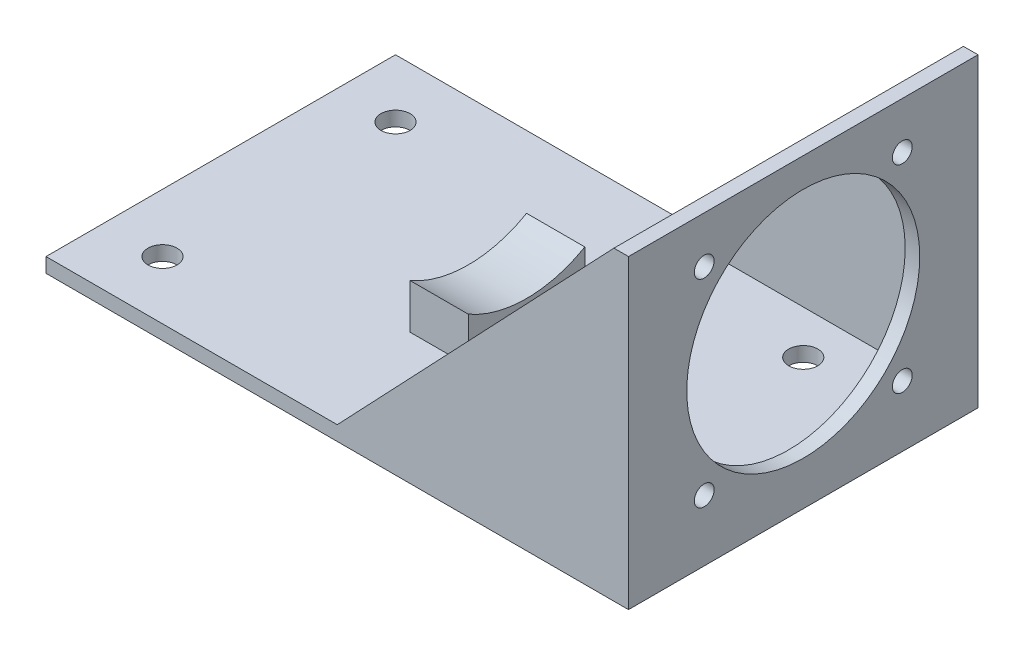
ISO-10303-21;
HEADER;
FILE_DESCRIPTION(('STEP AP214'),'2;1');
FILE_NAME('part.step','',(''),(''),'','','');
FILE_SCHEMA(('AUTOMOTIVE_DESIGN { 1 0 10303 214 1 1 1 1 }'));
ENDSEC;
DATA;
#1=APPLICATION_CONTEXT('core data for automotive mechanical design processes');
#2=APPLICATION_PROTOCOL_DEFINITION('international standard','automotive_design',2000,#1);
#3=PRODUCT_CONTEXT('',#1,'mechanical');
#4=PRODUCT('Part','Part','',(#3));
#5=PRODUCT_RELATED_PRODUCT_CATEGORY('part','',(#4));
#6=PRODUCT_DEFINITION_FORMATION('','',#4);
#7=PRODUCT_DEFINITION_CONTEXT('part definition',#1,'design');
#8=PRODUCT_DEFINITION('design','',#6,#7);
#9=PRODUCT_DEFINITION_SHAPE('','',#8);
#10=(LENGTH_UNIT() NAMED_UNIT(*) SI_UNIT(.MILLI.,.METRE.));
#11=(NAMED_UNIT(*) PLANE_ANGLE_UNIT() SI_UNIT($,.RADIAN.));
#12=(NAMED_UNIT(*) SI_UNIT($,.STERADIAN.) SOLID_ANGLE_UNIT());
#13=UNCERTAINTY_MEASURE_WITH_UNIT(LENGTH_MEASURE(1.E-05),#10,'distance_accuracy_value','');
#14=(GEOMETRIC_REPRESENTATION_CONTEXT(3) GLOBAL_UNCERTAINTY_ASSIGNED_CONTEXT((#13)) GLOBAL_UNIT_ASSIGNED_CONTEXT((#10,
#11,#12)) REPRESENTATION_CONTEXT('',''));
#15=CARTESIAN_POINT('',(0.,0.,0.));
#16=DIRECTION('',(0.,0.,1.));
#17=DIRECTION('',(1.,0.,0.));
#18=AXIS2_PLACEMENT_3D('',#15,#16,#17);
#19=CARTESIAN_POINT('',(0.,6.34999999999999,0.));
#20=DIRECTION('',(0.,1.,0.));
#21=DIRECTION('',(0.,0.,1.));
#22=AXIS2_PLACEMENT_3D('',#19,#20,#21);
#23=PLANE('',#22);
#24=CARTESIAN_POINT('',(76.2,6.34999999999999,-50.8));
#25=DIRECTION('',(0.,1.,0.));
#26=DIRECTION('',(0.,0.,1.));
#27=AXIS2_PLACEMENT_3D('',#24,#25,#26);
#28=CIRCLE('',#27,6.35);
#29=CARTESIAN_POINT('',(76.2,6.34999999999999,-44.45));
#30=VERTEX_POINT('',#29);
#31=EDGE_CURVE('E438',#30,#30,#28,.T.);
#32=ORIENTED_EDGE('',*,*,#31,.F.);
#33=EDGE_LOOP('',(#32));
#34=FACE_BOUND('',#33,.T.);
#35=CARTESIAN_POINT('',(76.2,6.34999999999999,50.8));
#36=DIRECTION('',(0.,1.,0.));
#37=DIRECTION('',(0.,0.,1.));
#38=AXIS2_PLACEMENT_3D('',#35,#36,#37);
#39=CIRCLE('',#38,6.35);
#40=CARTESIAN_POINT('',(76.2,6.34999999999999,57.15));
#41=VERTEX_POINT('',#40);
#42=EDGE_CURVE('E434',#41,#41,#39,.T.);
#43=ORIENTED_EDGE('',*,*,#42,.F.);
#44=EDGE_LOOP('',(#43));
#45=FACE_BOUND('',#44,.T.);
#46=CARTESIAN_POINT('',(-101.6,6.34999999999999,50.8));
#47=DIRECTION('',(0.,1.,0.));
#48=DIRECTION('',(0.,0.,1.));
#49=AXIS2_PLACEMENT_3D('',#46,#47,#48);
#50=CIRCLE('',#49,6.35);
#51=CARTESIAN_POINT('',(-101.6,6.34999999999999,57.15));
#52=VERTEX_POINT('',#51);
#53=EDGE_CURVE('E431',#52,#52,#50,.T.);
#54=ORIENTED_EDGE('',*,*,#53,.F.);
#55=EDGE_LOOP('',(#54));
#56=FACE_BOUND('',#55,.T.);
#57=CARTESIAN_POINT('',(-101.6,6.34999999999999,-50.8));
#58=DIRECTION('',(0.,1.,0.));
#59=DIRECTION('',(0.,0.,1.));
#60=AXIS2_PLACEMENT_3D('',#57,#58,#59);
#61=CIRCLE('',#60,6.35);
#62=CARTESIAN_POINT('',(-101.6,6.34999999999999,-44.45));
#63=VERTEX_POINT('',#62);
#64=EDGE_CURVE('E275',#63,#63,#61,.T.);
#65=ORIENTED_EDGE('',*,*,#64,.F.);
#66=EDGE_LOOP('',(#65));
#67=FACE_BOUND('',#66,.T.);
#68=DIRECTION('',(0.,0.,-1.));
#69=VECTOR('',#68,1.);
#70=CARTESIAN_POINT('',(0.,6.34999999999984,-69.85));
#71=LINE('',#70,#69);
#72=CARTESIAN_POINT('',(0.,6.34999999999984,-69.85));
#73=VERTEX_POINT('',#72);
#74=CARTESIAN_POINT('',(0.,6.34999999999999,-76.2));
#75=VERTEX_POINT('',#74);
#76=EDGE_CURVE('E178',#73,#75,#71,.T.);
#77=ORIENTED_EDGE('',*,*,#76,.T.);
#78=DIRECTION('',(-1.,0.,0.));
#79=VECTOR('',#78,1.);
#80=CARTESIAN_POINT('',(-127.,6.34999999999999,-76.2));
#81=LINE('',#80,#79);
#82=CARTESIAN_POINT('',(-127.,6.34999999999999,-76.2));
#83=VERTEX_POINT('',#82);
#84=EDGE_CURVE('E245',#75,#83,#81,.T.);
#85=ORIENTED_EDGE('',*,*,#84,.T.);
#86=DIRECTION('',(0.,0.,1.));
#87=VECTOR('',#86,1.);
#88=CARTESIAN_POINT('',(-127.,6.34999999999999,-76.2));
#89=LINE('',#88,#87);
#90=CARTESIAN_POINT('',(-127.,6.34999999999998,76.2));
#91=VERTEX_POINT('',#90);
#92=EDGE_CURVE('E247',#83,#91,#89,.T.);
#93=ORIENTED_EDGE('',*,*,#92,.T.);
#94=DIRECTION('',(1.,0.,0.));
#95=VECTOR('',#94,1.);
#96=CARTESIAN_POINT('',(-127.,6.34999999999998,76.2));
#97=LINE('',#96,#95);
#98=CARTESIAN_POINT('',(0.,6.34999999999998,76.2));
#99=VERTEX_POINT('',#98);
#100=EDGE_CURVE('E250',#91,#99,#97,.T.);
#101=ORIENTED_EDGE('',*,*,#100,.T.);
#102=DIRECTION('',(0.,0.,1.));
#103=VECTOR('',#102,1.);
#104=CARTESIAN_POINT('',(0.,6.34999999999999,69.85));
#105=LINE('',#104,#103);
#106=CARTESIAN_POINT('',(0.,6.34999999999999,69.85));
#107=VERTEX_POINT('',#106);
#108=EDGE_CURVE('E194',#107,#99,#105,.T.);
#109=ORIENTED_EDGE('',*,*,#108,.F.);
#110=DIRECTION('',(1.,0.,0.));
#111=VECTOR('',#110,1.);
#112=CARTESIAN_POINT('',(0.,6.34999999999999,69.85));
#113=LINE('',#112,#111);
#114=CARTESIAN_POINT('',(120.65,6.34999999999999,69.85));
#115=VERTEX_POINT('',#114);
#116=EDGE_CURVE('E188',#107,#115,#113,.T.);
#117=ORIENTED_EDGE('',*,*,#116,.T.);
#118=DIRECTION('',(0.,0.,-1.));
#119=VECTOR('',#118,1.);
#120=CARTESIAN_POINT('',(120.65,6.34999999999998,76.2));
#121=LINE('',#120,#119);
#122=CARTESIAN_POINT('',(120.65,6.34999999999984,-69.85));
#123=VERTEX_POINT('',#122);
#124=EDGE_CURVE('E229',#115,#123,#121,.T.);
#125=ORIENTED_EDGE('',*,*,#124,.T.);
#126=DIRECTION('',(-1.,0.,0.));
#127=VECTOR('',#126,1.);
#128=CARTESIAN_POINT('',(0.,6.34999999999984,-69.85));
#129=LINE('',#128,#127);
#130=EDGE_CURVE('E172',#123,#73,#129,.T.);
#131=ORIENTED_EDGE('',*,*,#130,.T.);
#132=EDGE_LOOP('',(#77,#85,#93,#101,#109,#117,#125,#131));
#133=FACE_BOUND('',#132,.T.);
#134=DIRECTION('',(-1.,0.,0.));
#135=VECTOR('',#134,1.);
#136=CARTESIAN_POINT('',(-19.05,6.34999999999998,-25.4));
#137=LINE('',#136,#135);
#138=CARTESIAN_POINT('',(6.34999999999997,6.34999999999998,-25.4));
#139=VERTEX_POINT('',#138);
#140=CARTESIAN_POINT('',(-19.05,6.34999999999998,-25.4));
#141=VERTEX_POINT('',#140);
#142=EDGE_CURVE('E159',#139,#141,#137,.T.);
#143=ORIENTED_EDGE('',*,*,#142,.F.);
#144=DIRECTION('',(0.,0.,-1.));
#145=VECTOR('',#144,1.);
#146=CARTESIAN_POINT('',(6.34999999999997,6.34999999999998,-25.4));
#147=LINE('',#146,#145);
#148=CARTESIAN_POINT('',(6.34999999999997,6.34999999999999,25.4));
#149=VERTEX_POINT('',#148);
#150=EDGE_CURVE('E150',#149,#139,#147,.T.);
#151=ORIENTED_EDGE('',*,*,#150,.F.);
#152=DIRECTION('',(1.,0.,0.));
#153=VECTOR('',#152,1.);
#154=CARTESIAN_POINT('',(-19.05,6.34999999999999,25.4));
#155=LINE('',#154,#153);
#156=CARTESIAN_POINT('',(-19.05,6.34999999999999,25.4));
#157=VERTEX_POINT('',#156);
#158=EDGE_CURVE('E446',#157,#149,#155,.T.);
#159=ORIENTED_EDGE('',*,*,#158,.F.);
#160=DIRECTION('',(0.,0.,1.));
#161=VECTOR('',#160,1.);
#162=CARTESIAN_POINT('',(-19.05,6.34999999999998,-25.4));
#163=LINE('',#162,#161);
#164=EDGE_CURVE('E444',#141,#157,#163,.T.);
#165=ORIENTED_EDGE('',*,*,#164,.F.);
#166=EDGE_LOOP('',(#143,#151,#159,#165));
#167=FACE_BOUND('',#166,.T.);
#168=ADVANCED_FACE('F48',(#34,#45,#56,#67,#133,#167),#23,.T.);
#169=CARTESIAN_POINT('',(120.65,0.,0.));
#170=DIRECTION('',(-1.,0.,0.));
#171=DIRECTION('',(0.,0.,1.));
#172=AXIS2_PLACEMENT_3D('',#169,#170,#171);
#173=PLANE('',#172);
#174=CARTESIAN_POINT('',(120.65,113.03,43.18));
#175=DIRECTION('',(1.,0.,0.));
#176=DIRECTION('',(0.,0.,-1.));
#177=AXIS2_PLACEMENT_3D('',#174,#175,#176);
#178=CIRCLE('',#177,4.318);
#179=CARTESIAN_POINT('',(120.65,113.03,38.862));
#180=VERTEX_POINT('',#179);
#181=EDGE_CURVE('E199',#180,#180,#178,.T.);
#182=ORIENTED_EDGE('',*,*,#181,.T.);
#183=EDGE_LOOP('',(#182));
#184=FACE_BOUND('',#183,.T.);
#185=CARTESIAN_POINT('',(120.65,113.03,-43.18));
#186=DIRECTION('',(1.,0.,0.));
#187=DIRECTION('',(0.,0.,-1.));
#188=AXIS2_PLACEMENT_3D('',#185,#186,#187);
#189=CIRCLE('',#188,4.318);
#190=CARTESIAN_POINT('',(120.65,113.03,-47.498));
#191=VERTEX_POINT('',#190);
#192=EDGE_CURVE('E205',#191,#191,#189,.T.);
#193=ORIENTED_EDGE('',*,*,#192,.T.);
#194=EDGE_LOOP('',(#193));
#195=FACE_BOUND('',#194,.T.);
#196=CARTESIAN_POINT('',(120.65,26.67,-43.18));
#197=DIRECTION('',(1.,0.,0.));
#198=DIRECTION('',(0.,0.,-1.));
#199=AXIS2_PLACEMENT_3D('',#196,#197,#198);
#200=CIRCLE('',#199,4.318);
#201=CARTESIAN_POINT('',(120.65,26.67,-47.498));
#202=VERTEX_POINT('',#201);
#203=EDGE_CURVE('E211',#202,#202,#200,.T.);
#204=ORIENTED_EDGE('',*,*,#203,.T.);
#205=EDGE_LOOP('',(#204));
#206=FACE_BOUND('',#205,.T.);
#207=CARTESIAN_POINT('',(120.65,26.67,43.18));
#208=DIRECTION('',(1.,0.,0.));
#209=DIRECTION('',(0.,0.,-1.));
#210=AXIS2_PLACEMENT_3D('',#207,#208,#209);
#211=CIRCLE('',#210,4.318);
#212=CARTESIAN_POINT('',(120.65,26.67,38.862));
#213=VERTEX_POINT('',#212);
#214=EDGE_CURVE('E217',#213,#213,#211,.T.);
#215=ORIENTED_EDGE('',*,*,#214,.T.);
#216=EDGE_LOOP('',(#215));
#217=FACE_BOUND('',#216,.T.);
#218=CARTESIAN_POINT('',(120.65,69.85,0.));
#219=DIRECTION('',(1.,0.,0.));
#220=DIRECTION('',(0.,0.,-1.));
#221=AXIS2_PLACEMENT_3D('',#218,#219,#220);
#222=CIRCLE('',#221,50.8);
#223=CARTESIAN_POINT('',(120.65,69.85,-50.8));
#224=VERTEX_POINT('',#223);
#225=EDGE_CURVE('E223',#224,#224,#222,.T.);
#226=ORIENTED_EDGE('',*,*,#225,.T.);
#227=EDGE_LOOP('',(#226));
#228=FACE_BOUND('',#227,.T.);
#229=DIRECTION('',(0.,0.,1.));
#230=VECTOR('',#229,1.);
#231=CARTESIAN_POINT('',(120.65,133.35,76.2));
#232=LINE('',#231,#230);
#233=CARTESIAN_POINT('',(120.65,133.35,-69.85));
#234=VERTEX_POINT('',#233);
#235=CARTESIAN_POINT('',(120.65,133.35,69.85));
#236=VERTEX_POINT('',#235);
#237=EDGE_CURVE('E232',#234,#236,#232,.T.);
#238=ORIENTED_EDGE('',*,*,#237,.F.);
#239=DIRECTION('',(0.,-1.,0.));
#240=VECTOR('',#239,1.);
#241=CARTESIAN_POINT('',(120.65,6.34999999999984,-69.85));
#242=LINE('',#241,#240);
#243=EDGE_CURVE('E169',#234,#123,#242,.T.);
#244=ORIENTED_EDGE('',*,*,#243,.T.);
#245=ORIENTED_EDGE('',*,*,#124,.F.);
#246=DIRECTION('',(0.,1.,0.));
#247=VECTOR('',#246,1.);
#248=CARTESIAN_POINT('',(120.65,6.34999999999999,69.85));
#249=LINE('',#248,#247);
#250=EDGE_CURVE('E183',#115,#236,#249,.T.);
#251=ORIENTED_EDGE('',*,*,#250,.T.);
#252=EDGE_LOOP('',(#238,#244,#245,#251));
#253=FACE_BOUND('',#252,.T.);
#254=ADVANCED_FACE('F300',(#184,#195,#206,#217,#228,#253),#173,.T.);
#255=CARTESIAN_POINT('',(127.,6.34999999999999,-76.2));
#256=DIRECTION('',(-1.,0.,0.));
#257=DIRECTION('',(0.,0.,1.));
#258=AXIS2_PLACEMENT_3D('',#255,#256,#257);
#259=PLANE('',#258);
#260=DIRECTION('',(0.,0.,-1.));
#261=VECTOR('',#260,1.);
#262=CARTESIAN_POINT('',(127.,0.,-76.2));
#263=LINE('',#262,#261);
#264=CARTESIAN_POINT('',(127.,0.,76.2));
#265=VERTEX_POINT('',#264);
#266=CARTESIAN_POINT('',(127.,0.,-76.2));
#267=VERTEX_POINT('',#266);
#268=EDGE_CURVE('E242',#265,#267,#263,.T.);
#269=ORIENTED_EDGE('',*,*,#268,.T.);
#270=DIRECTION('',(0.,-1.,0.));
#271=VECTOR('',#270,1.);
#272=CARTESIAN_POINT('',(127.,6.34999999999999,-76.2));
#273=LINE('',#272,#271);
#274=CARTESIAN_POINT('',(127.,133.35,-76.2));
#275=VERTEX_POINT('',#274);
#276=EDGE_CURVE('E57',#275,#267,#273,.T.);
#277=ORIENTED_EDGE('',*,*,#276,.F.);
#278=DIRECTION('',(0.,0.,1.));
#279=VECTOR('',#278,1.);
#280=CARTESIAN_POINT('',(127.,133.35,76.2));
#281=LINE('',#280,#279);
#282=CARTESIAN_POINT('',(127.,133.35,76.2));
#283=VERTEX_POINT('',#282);
#284=EDGE_CURVE('E226',#275,#283,#281,.T.);
#285=ORIENTED_EDGE('',*,*,#284,.T.);
#286=DIRECTION('',(0.,-1.,0.));
#287=VECTOR('',#286,1.);
#288=CARTESIAN_POINT('',(127.,6.34999999999998,76.2));
#289=LINE('',#288,#287);
#290=EDGE_CURVE('E253',#283,#265,#289,.T.);
#291=ORIENTED_EDGE('',*,*,#290,.T.);
#292=EDGE_LOOP('',(#269,#277,#285,#291));
#293=FACE_BOUND('',#292,.T.);
#294=CARTESIAN_POINT('',(127.,113.03,43.18));
#295=DIRECTION('',(1.,0.,0.));
#296=DIRECTION('',(0.,0.,-1.));
#297=AXIS2_PLACEMENT_3D('',#294,#295,#296);
#298=CIRCLE('',#297,4.318);
#299=CARTESIAN_POINT('',(127.,113.03,38.862));
#300=VERTEX_POINT('',#299);
#301=EDGE_CURVE('E196',#300,#300,#298,.T.);
#302=ORIENTED_EDGE('',*,*,#301,.F.);
#303=EDGE_LOOP('',(#302));
#304=FACE_BOUND('',#303,.T.);
#305=CARTESIAN_POINT('',(127.,113.03,-43.18));
#306=DIRECTION('',(1.,0.,0.));
#307=DIRECTION('',(0.,0.,-1.));
#308=AXIS2_PLACEMENT_3D('',#305,#306,#307);
#309=CIRCLE('',#308,4.318);
#310=CARTESIAN_POINT('',(127.,113.03,-47.498));
#311=VERTEX_POINT('',#310);
#312=EDGE_CURVE('E202',#311,#311,#309,.T.);
#313=ORIENTED_EDGE('',*,*,#312,.F.);
#314=EDGE_LOOP('',(#313));
#315=FACE_BOUND('',#314,.T.);
#316=CARTESIAN_POINT('',(127.,26.67,-43.18));
#317=DIRECTION('',(1.,0.,0.));
#318=DIRECTION('',(0.,0.,-1.));
#319=AXIS2_PLACEMENT_3D('',#316,#317,#318);
#320=CIRCLE('',#319,4.318);
#321=CARTESIAN_POINT('',(127.,26.67,-47.498));
#322=VERTEX_POINT('',#321);
#323=EDGE_CURVE('E208',#322,#322,#320,.T.);
#324=ORIENTED_EDGE('',*,*,#323,.F.);
#325=EDGE_LOOP('',(#324));
#326=FACE_BOUND('',#325,.T.);
#327=CARTESIAN_POINT('',(127.,26.67,43.18));
#328=DIRECTION('',(1.,0.,0.));
#329=DIRECTION('',(0.,0.,-1.));
#330=AXIS2_PLACEMENT_3D('',#327,#328,#329);
#331=CIRCLE('',#330,4.318);
#332=CARTESIAN_POINT('',(127.,26.67,38.862));
#333=VERTEX_POINT('',#332);
#334=EDGE_CURVE('E214',#333,#333,#331,.T.);
#335=ORIENTED_EDGE('',*,*,#334,.F.);
#336=EDGE_LOOP('',(#335));
#337=FACE_BOUND('',#336,.T.);
#338=CARTESIAN_POINT('',(127.,69.85,0.));
#339=DIRECTION('',(1.,0.,0.));
#340=DIRECTION('',(0.,0.,-1.));
#341=AXIS2_PLACEMENT_3D('',#338,#339,#340);
#342=CIRCLE('',#341,50.8);
#343=CARTESIAN_POINT('',(127.,69.85,-50.8));
#344=VERTEX_POINT('',#343);
#345=EDGE_CURVE('E220',#344,#344,#342,.T.);
#346=ORIENTED_EDGE('',*,*,#345,.F.);
#347=EDGE_LOOP('',(#346));
#348=FACE_BOUND('',#347,.T.);
#349=ADVANCED_FACE('F50',(#293,#304,#315,#326,#337,#348),#259,.F.);
#350=CARTESIAN_POINT('',(-127.,6.34999999999999,-76.2));
#351=DIRECTION('',(0.,0.,1.));
#352=DIRECTION('',(1.,0.,0.));
#353=AXIS2_PLACEMENT_3D('',#350,#351,#352);
#354=PLANE('',#353);
#355=ORIENTED_EDGE('',*,*,#84,.F.);
#356=DIRECTION('',(0.688749461914693,0.724999433594414,0.));
#357=VECTOR('',#356,1.);
#358=CARTESIAN_POINT('',(120.65,133.35,-76.2));
#359=LINE('',#358,#357);
#360=CARTESIAN_POINT('',(120.65,133.35,-76.2));
#361=VERTEX_POINT('',#360);
#362=EDGE_CURVE('E163',#75,#361,#359,.T.);
#363=ORIENTED_EDGE('',*,*,#362,.T.);
#364=DIRECTION('',(1.,0.,0.));
#365=VECTOR('',#364,1.);
#366=CARTESIAN_POINT('',(120.65,133.35,-76.2));
#367=LINE('',#366,#365);
#368=EDGE_CURVE('E236',#361,#275,#367,.T.);
#369=ORIENTED_EDGE('',*,*,#368,.T.);
#370=ORIENTED_EDGE('',*,*,#276,.T.);
#371=DIRECTION('',(-1.,0.,0.));
#372=VECTOR('',#371,1.);
#373=CARTESIAN_POINT('',(-127.,0.,-76.2));
#374=LINE('',#373,#372);
#375=CARTESIAN_POINT('',(-127.,0.,-76.2));
#376=VERTEX_POINT('',#375);
#377=EDGE_CURVE('E256',#267,#376,#374,.T.);
#378=ORIENTED_EDGE('',*,*,#377,.T.);
#379=DIRECTION('',(0.,-1.,0.));
#380=VECTOR('',#379,1.);
#381=CARTESIAN_POINT('',(-127.,6.34999999999999,-76.2));
#382=LINE('',#381,#380);
#383=EDGE_CURVE('E266',#83,#376,#382,.T.);
#384=ORIENTED_EDGE('',*,*,#383,.F.);
#385=EDGE_LOOP('',(#355,#363,#369,#370,#378,#384));
#386=FACE_BOUND('',#385,.T.);
#387=ADVANCED_FACE('F321',(#386),#354,.F.);
#388=CARTESIAN_POINT('',(-127.,6.34999999999999,-76.2));
#389=DIRECTION('',(1.,0.,0.));
#390=DIRECTION('',(0.,0.,-1.));
#391=AXIS2_PLACEMENT_3D('',#388,#389,#390);
#392=PLANE('',#391);
#393=DIRECTION('',(0.,0.,1.));
#394=VECTOR('',#393,1.);
#395=CARTESIAN_POINT('',(-127.,0.,-76.2));
#396=LINE('',#395,#394);
#397=CARTESIAN_POINT('',(-127.,0.,76.2));
#398=VERTEX_POINT('',#397);
#399=EDGE_CURVE('E258',#376,#398,#396,.T.);
#400=ORIENTED_EDGE('',*,*,#399,.T.);
#401=DIRECTION('',(0.,-1.,0.));
#402=VECTOR('',#401,1.);
#403=CARTESIAN_POINT('',(-127.,6.34999999999998,76.2));
#404=LINE('',#403,#402);
#405=EDGE_CURVE('E263',#91,#398,#404,.T.);
#406=ORIENTED_EDGE('',*,*,#405,.F.);
#407=ORIENTED_EDGE('',*,*,#92,.F.);
#408=ORIENTED_EDGE('',*,*,#383,.T.);
#409=EDGE_LOOP('',(#400,#406,#407,#408));
#410=FACE_BOUND('',#409,.T.);
#411=ADVANCED_FACE('F318',(#410),#392,.F.);
#412=CARTESIAN_POINT('',(-127.,6.34999999999998,76.2));
#413=DIRECTION('',(0.,0.,-1.));
#414=DIRECTION('',(-1.,0.,0.));
#415=AXIS2_PLACEMENT_3D('',#412,#413,#414);
#416=PLANE('',#415);
#417=DIRECTION('',(1.,0.,0.));
#418=VECTOR('',#417,1.);
#419=CARTESIAN_POINT('',(-127.,0.,76.2));
#420=LINE('',#419,#418);
#421=EDGE_CURVE('E248',#398,#265,#420,.T.);
#422=ORIENTED_EDGE('',*,*,#421,.T.);
#423=ORIENTED_EDGE('',*,*,#290,.F.);
#424=DIRECTION('',(1.,0.,0.));
#425=VECTOR('',#424,1.);
#426=CARTESIAN_POINT('',(120.65,133.35,76.2));
#427=LINE('',#426,#425);
#428=CARTESIAN_POINT('',(120.65,133.35,76.2));
#429=VERTEX_POINT('',#428);
#430=EDGE_CURVE('E239',#429,#283,#427,.T.);
#431=ORIENTED_EDGE('',*,*,#430,.F.);
#432=DIRECTION('',(-0.688749461914693,-0.724999433594414,0.));
#433=VECTOR('',#432,1.);
#434=CARTESIAN_POINT('',(120.65,133.35,76.2));
#435=LINE('',#434,#433);
#436=EDGE_CURVE('E182',#429,#99,#435,.T.);
#437=ORIENTED_EDGE('',*,*,#436,.T.);
#438=ORIENTED_EDGE('',*,*,#100,.F.);
#439=ORIENTED_EDGE('',*,*,#405,.T.);
#440=EDGE_LOOP('',(#422,#423,#431,#437,#438,#439));
#441=FACE_BOUND('',#440,.T.);
#442=ADVANCED_FACE('F315',(#441),#416,.F.);
#443=CARTESIAN_POINT('',(0.,0.,0.));
#444=DIRECTION('',(0.,1.,0.));
#445=DIRECTION('',(0.,0.,1.));
#446=AXIS2_PLACEMENT_3D('',#443,#444,#445);
#447=PLANE('',#446);
#448=CARTESIAN_POINT('',(76.2,0.,-50.8));
#449=DIRECTION('',(0.,1.,0.));
#450=DIRECTION('',(0.,0.,1.));
#451=AXIS2_PLACEMENT_3D('',#448,#449,#450);
#452=CIRCLE('',#451,6.35);
#453=CARTESIAN_POINT('',(76.2,0.,-44.45));
#454=VERTEX_POINT('',#453);
#455=EDGE_CURVE('E52',#454,#454,#452,.T.);
#456=ORIENTED_EDGE('',*,*,#455,.T.);
#457=EDGE_LOOP('',(#456));
#458=FACE_BOUND('',#457,.T.);
#459=CARTESIAN_POINT('',(76.2,0.,50.8));
#460=DIRECTION('',(0.,1.,0.));
#461=DIRECTION('',(0.,0.,1.));
#462=AXIS2_PLACEMENT_3D('',#459,#460,#461);
#463=CIRCLE('',#462,6.35);
#464=CARTESIAN_POINT('',(76.2,0.,57.15));
#465=VERTEX_POINT('',#464);
#466=EDGE_CURVE('E277',#465,#465,#463,.T.);
#467=ORIENTED_EDGE('',*,*,#466,.T.);
#468=EDGE_LOOP('',(#467));
#469=FACE_BOUND('',#468,.T.);
#470=CARTESIAN_POINT('',(-101.6,0.,50.8));
#471=DIRECTION('',(0.,1.,0.));
#472=DIRECTION('',(0.,0.,1.));
#473=AXIS2_PLACEMENT_3D('',#470,#471,#472);
#474=CIRCLE('',#473,6.35);
#475=CARTESIAN_POINT('',(-101.6,0.,57.15));
#476=VERTEX_POINT('',#475);
#477=EDGE_CURVE('E274',#476,#476,#474,.T.);
#478=ORIENTED_EDGE('',*,*,#477,.T.);
#479=EDGE_LOOP('',(#478));
#480=FACE_BOUND('',#479,.T.);
#481=CARTESIAN_POINT('',(-101.6,0.,-50.8));
#482=DIRECTION('',(0.,1.,0.));
#483=DIRECTION('',(0.,0.,1.));
#484=AXIS2_PLACEMENT_3D('',#481,#482,#483);
#485=CIRCLE('',#484,6.35);
#486=CARTESIAN_POINT('',(-101.6,0.,-44.45));
#487=VERTEX_POINT('',#486);
#488=EDGE_CURVE('E271',#487,#487,#485,.T.);
#489=ORIENTED_EDGE('',*,*,#488,.T.);
#490=EDGE_LOOP('',(#489));
#491=FACE_BOUND('',#490,.T.);
#492=ORIENTED_EDGE('',*,*,#268,.F.);
#493=ORIENTED_EDGE('',*,*,#421,.F.);
#494=ORIENTED_EDGE('',*,*,#399,.F.);
#495=ORIENTED_EDGE('',*,*,#377,.F.);
#496=EDGE_LOOP('',(#492,#493,#494,#495));
#497=FACE_BOUND('',#496,.T.);
#498=ADVANCED_FACE('F284',(#458,#469,#480,#491,#497),#447,.F.);
#499=CARTESIAN_POINT('',(120.65,133.35,76.2));
#500=DIRECTION('',(0.,1.,0.));
#501=DIRECTION('',(0.,0.,1.));
#502=AXIS2_PLACEMENT_3D('',#499,#500,#501);
#503=PLANE('',#502);
#504=ORIENTED_EDGE('',*,*,#284,.F.);
#505=ORIENTED_EDGE('',*,*,#368,.F.);
#506=EDGE_CURVE('E233',#361,#234,#232,.T.);
#507=ORIENTED_EDGE('',*,*,#506,.T.);
#508=ORIENTED_EDGE('',*,*,#237,.T.);
#509=DIRECTION('',(0.,0.,1.));
#510=VECTOR('',#509,1.);
#511=CARTESIAN_POINT('',(120.65,133.35,69.85));
#512=LINE('',#511,#510);
#513=EDGE_CURVE('E191',#236,#429,#512,.T.);
#514=ORIENTED_EDGE('',*,*,#513,.T.);
#515=ORIENTED_EDGE('',*,*,#430,.T.);
#516=EDGE_LOOP('',(#504,#505,#507,#508,#514,#515));
#517=FACE_BOUND('',#516,.T.);
#518=ADVANCED_FACE('F312',(#517),#503,.T.);
#519=CARTESIAN_POINT('',(120.65,69.85,0.));
#520=DIRECTION('',(1.,0.,0.));
#521=DIRECTION('',(0.,0.,-1.));
#522=AXIS2_PLACEMENT_3D('',#519,#520,#521);
#523=CYLINDRICAL_SURFACE('',#522,50.8);
#524=ORIENTED_EDGE('',*,*,#225,.F.);
#525=EDGE_LOOP('',(#524));
#526=FACE_BOUND('',#525,.T.);
#527=ORIENTED_EDGE('',*,*,#345,.T.);
#528=EDGE_LOOP('',(#527));
#529=FACE_BOUND('',#528,.T.);
#530=ADVANCED_FACE('F372',(#526,#529),#523,.F.);
#531=CARTESIAN_POINT('',(120.65,26.67,43.18));
#532=DIRECTION('',(1.,0.,0.));
#533=DIRECTION('',(0.,0.,-1.));
#534=AXIS2_PLACEMENT_3D('',#531,#532,#533);
#535=CYLINDRICAL_SURFACE('',#534,4.318);
#536=ORIENTED_EDGE('',*,*,#214,.F.);
#537=EDGE_LOOP('',(#536));
#538=FACE_BOUND('',#537,.T.);
#539=ORIENTED_EDGE('',*,*,#334,.T.);
#540=EDGE_LOOP('',(#539));
#541=FACE_BOUND('',#540,.T.);
#542=ADVANCED_FACE('F374',(#538,#541),#535,.F.);
#543=CARTESIAN_POINT('',(120.65,26.67,-43.18));
#544=DIRECTION('',(1.,0.,0.));
#545=DIRECTION('',(0.,0.,-1.));
#546=AXIS2_PLACEMENT_3D('',#543,#544,#545);
#547=CYLINDRICAL_SURFACE('',#546,4.318);
#548=ORIENTED_EDGE('',*,*,#203,.F.);
#549=EDGE_LOOP('',(#548));
#550=FACE_BOUND('',#549,.T.);
#551=ORIENTED_EDGE('',*,*,#323,.T.);
#552=EDGE_LOOP('',(#551));
#553=FACE_BOUND('',#552,.T.);
#554=ADVANCED_FACE('F381',(#550,#553),#547,.F.);
#555=CARTESIAN_POINT('',(120.65,113.03,-43.18));
#556=DIRECTION('',(1.,0.,0.));
#557=DIRECTION('',(0.,0.,-1.));
#558=AXIS2_PLACEMENT_3D('',#555,#556,#557);
#559=CYLINDRICAL_SURFACE('',#558,4.318);
#560=ORIENTED_EDGE('',*,*,#192,.F.);
#561=EDGE_LOOP('',(#560));
#562=FACE_BOUND('',#561,.T.);
#563=ORIENTED_EDGE('',*,*,#312,.T.);
#564=EDGE_LOOP('',(#563));
#565=FACE_BOUND('',#564,.T.);
#566=ADVANCED_FACE('F388',(#562,#565),#559,.F.);
#567=CARTESIAN_POINT('',(120.65,113.03,43.18));
#568=DIRECTION('',(1.,0.,0.));
#569=DIRECTION('',(0.,0.,-1.));
#570=AXIS2_PLACEMENT_3D('',#567,#568,#569);
#571=CYLINDRICAL_SURFACE('',#570,4.318);
#572=ORIENTED_EDGE('',*,*,#181,.F.);
#573=EDGE_LOOP('',(#572));
#574=FACE_BOUND('',#573,.T.);
#575=ORIENTED_EDGE('',*,*,#301,.T.);
#576=EDGE_LOOP('',(#575));
#577=FACE_BOUND('',#576,.T.);
#578=ADVANCED_FACE('F392',(#574,#577),#571,.F.);
#579=CARTESIAN_POINT('',(120.65,133.35,69.85));
#580=DIRECTION('',(-0.724999433594414,0.688749461914693,0.));
#581=DIRECTION('',(-0.688749461914693,-0.724999433594414,0.));
#582=AXIS2_PLACEMENT_3D('',#579,#580,#581);
#583=PLANE('',#582);
#584=ORIENTED_EDGE('',*,*,#436,.F.);
#585=ORIENTED_EDGE('',*,*,#513,.F.);
#586=DIRECTION('',(-0.688749461914693,-0.724999433594414,0.));
#587=VECTOR('',#586,1.);
#588=CARTESIAN_POINT('',(120.65,133.35,69.85));
#589=LINE('',#588,#587);
#590=EDGE_CURVE('E186',#236,#107,#589,.T.);
#591=ORIENTED_EDGE('',*,*,#590,.T.);
#592=ORIENTED_EDGE('',*,*,#108,.T.);
#593=EDGE_LOOP('',(#584,#585,#591,#592));
#594=FACE_BOUND('',#593,.T.);
#595=ADVANCED_FACE('F351',(#594),#583,.T.);
#596=CARTESIAN_POINT('',(0.,0.,69.85));
#597=DIRECTION('',(0.,0.,-1.));
#598=DIRECTION('',(-1.,0.,0.));
#599=AXIS2_PLACEMENT_3D('',#596,#597,#598);
#600=PLANE('',#599);
#601=ORIENTED_EDGE('',*,*,#250,.F.);
#602=ORIENTED_EDGE('',*,*,#116,.F.);
#603=ORIENTED_EDGE('',*,*,#590,.F.);
#604=EDGE_LOOP('',(#601,#602,#603));
#605=FACE_BOUND('',#604,.T.);
#606=ADVANCED_FACE('F348',(#605),#600,.T.);
#607=CARTESIAN_POINT('',(120.65,133.35,-69.85));
#608=DIRECTION('',(-0.724999433594414,0.688749461914693,0.));
#609=DIRECTION('',(-0.688749461914693,-0.724999433594414,0.));
#610=AXIS2_PLACEMENT_3D('',#607,#608,#609);
#611=PLANE('',#610);
#612=ORIENTED_EDGE('',*,*,#362,.F.);
#613=ORIENTED_EDGE('',*,*,#76,.F.);
#614=DIRECTION('',(0.688749461914693,0.724999433594414,0.));
#615=VECTOR('',#614,1.);
#616=CARTESIAN_POINT('',(120.65,133.35,-69.85));
#617=LINE('',#616,#615);
#618=EDGE_CURVE('E175',#73,#234,#617,.T.);
#619=ORIENTED_EDGE('',*,*,#618,.T.);
#620=ORIENTED_EDGE('',*,*,#506,.F.);
#621=EDGE_LOOP('',(#612,#613,#619,#620));
#622=FACE_BOUND('',#621,.T.);
#623=ADVANCED_FACE('F338',(#622),#611,.T.);
#624=CARTESIAN_POINT('',(0.,0.,-69.85));
#625=DIRECTION('',(0.,0.,-1.));
#626=DIRECTION('',(-1.,0.,0.));
#627=AXIS2_PLACEMENT_3D('',#624,#625,#626);
#628=PLANE('',#627);
#629=ORIENTED_EDGE('',*,*,#243,.F.);
#630=ORIENTED_EDGE('',*,*,#618,.F.);
#631=ORIENTED_EDGE('',*,*,#130,.F.);
#632=EDGE_LOOP('',(#629,#630,#631));
#633=FACE_BOUND('',#632,.T.);
#634=ADVANCED_FACE('F341',(#633),#628,.F.);
#635=CARTESIAN_POINT('',(6.34999999999997,31.75,-25.4));
#636=DIRECTION('',(-1.,0.,0.));
#637=DIRECTION('',(0.,0.,1.));
#638=AXIS2_PLACEMENT_3D('',#635,#636,#637);
#639=PLANE('',#638);
#640=DIRECTION('',(0.,-1.,0.));
#641=VECTOR('',#640,1.);
#642=CARTESIAN_POINT('',(6.34999999999997,31.75,-25.4));
#643=LINE('',#642,#641);
#644=CARTESIAN_POINT('',(6.34999999999997,25.8559094877505,-25.4));
#645=VERTEX_POINT('',#644);
#646=EDGE_CURVE('E161',#645,#139,#643,.T.);
#647=ORIENTED_EDGE('',*,*,#646,.F.);
#648=CARTESIAN_POINT('',(6.34999999999997,69.85,0.));
#649=DIRECTION('',(-1.,0.,0.));
#650=DIRECTION('',(0.,0.,1.));
#651=AXIS2_PLACEMENT_3D('',#648,#649,#650);
#652=CIRCLE('',#651,50.8);
#653=CARTESIAN_POINT('',(6.34999999999997,25.8559094877505,25.4));
#654=VERTEX_POINT('',#653);
#655=EDGE_CURVE('E146',#645,#654,#652,.T.);
#656=ORIENTED_EDGE('',*,*,#655,.T.);
#657=DIRECTION('',(0.,-1.,0.));
#658=VECTOR('',#657,1.);
#659=CARTESIAN_POINT('',(6.34999999999997,31.75,25.4));
#660=LINE('',#659,#658);
#661=EDGE_CURVE('E165',#654,#149,#660,.T.);
#662=ORIENTED_EDGE('',*,*,#661,.T.);
#663=ORIENTED_EDGE('',*,*,#150,.T.);
#664=EDGE_LOOP('',(#647,#656,#662,#663));
#665=FACE_BOUND('',#664,.T.);
#666=ADVANCED_FACE('F405',(#665),#639,.F.);
#667=CARTESIAN_POINT('',(-19.05,31.75,-25.4));
#668=DIRECTION('',(0.,0.,1.));
#669=DIRECTION('',(1.,0.,0.));
#670=AXIS2_PLACEMENT_3D('',#667,#668,#669);
#671=PLANE('',#670);
#672=DIRECTION('',(0.,-1.,0.));
#673=VECTOR('',#672,1.);
#674=CARTESIAN_POINT('',(-19.05,31.75,-25.4));
#675=LINE('',#674,#673);
#676=CARTESIAN_POINT('',(-19.05,25.8559094877505,-25.4));
#677=VERTEX_POINT('',#676);
#678=EDGE_CURVE('E154',#677,#141,#675,.T.);
#679=ORIENTED_EDGE('',*,*,#678,.F.);
#680=DIRECTION('',(-1.,0.,0.));
#681=VECTOR('',#680,1.);
#682=CARTESIAN_POINT('',(6.34999999999997,25.8559094877505,-25.4));
#683=LINE('',#682,#681);
#684=EDGE_CURVE('E143',#677,#645,#683,.F.);
#685=ORIENTED_EDGE('',*,*,#684,.T.);
#686=ORIENTED_EDGE('',*,*,#646,.T.);
#687=ORIENTED_EDGE('',*,*,#142,.T.);
#688=EDGE_LOOP('',(#679,#685,#686,#687));
#689=FACE_BOUND('',#688,.T.);
#690=ADVANCED_FACE('F157',(#689),#671,.F.);
#691=CARTESIAN_POINT('',(-19.05,31.75,-25.4));
#692=DIRECTION('',(1.,0.,0.));
#693=DIRECTION('',(0.,0.,-1.));
#694=AXIS2_PLACEMENT_3D('',#691,#692,#693);
#695=PLANE('',#694);
#696=DIRECTION('',(0.,-1.,0.));
#697=VECTOR('',#696,1.);
#698=CARTESIAN_POINT('',(-19.05,31.75,25.4));
#699=LINE('',#698,#697);
#700=CARTESIAN_POINT('',(-19.05,25.8559094877505,25.4));
#701=VERTEX_POINT('',#700);
#702=EDGE_CURVE('E71',#701,#157,#699,.T.);
#703=ORIENTED_EDGE('',*,*,#702,.F.);
#704=CARTESIAN_POINT('',(-19.05,69.85,0.));
#705=DIRECTION('',(-1.,0.,0.));
#706=DIRECTION('',(0.,0.,1.));
#707=AXIS2_PLACEMENT_3D('',#704,#705,#706);
#708=CIRCLE('',#707,50.8);
#709=EDGE_CURVE('E65',#677,#701,#708,.T.);
#710=ORIENTED_EDGE('',*,*,#709,.F.);
#711=ORIENTED_EDGE('',*,*,#678,.T.);
#712=ORIENTED_EDGE('',*,*,#164,.T.);
#713=EDGE_LOOP('',(#703,#710,#711,#712));
#714=FACE_BOUND('',#713,.T.);
#715=ADVANCED_FACE('F153',(#714),#695,.F.);
#716=CARTESIAN_POINT('',(-19.05,31.75,25.4));
#717=DIRECTION('',(0.,0.,-1.));
#718=DIRECTION('',(-1.,0.,0.));
#719=AXIS2_PLACEMENT_3D('',#716,#717,#718);
#720=PLANE('',#719);
#721=ORIENTED_EDGE('',*,*,#661,.F.);
#722=DIRECTION('',(-1.,0.,0.));
#723=VECTOR('',#722,1.);
#724=CARTESIAN_POINT('',(6.34999999999997,25.8559094877505,25.4));
#725=LINE('',#724,#723);
#726=EDGE_CURVE('E13',#654,#701,#725,.T.);
#727=ORIENTED_EDGE('',*,*,#726,.T.);
#728=ORIENTED_EDGE('',*,*,#702,.T.);
#729=ORIENTED_EDGE('',*,*,#158,.T.);
#730=EDGE_LOOP('',(#721,#727,#728,#729));
#731=FACE_BOUND('',#730,.T.);
#732=ADVANCED_FACE('F413',(#731),#720,.F.);
#733=CARTESIAN_POINT('',(6.34999999999997,69.85,0.));
#734=DIRECTION('',(-1.,0.,0.));
#735=DIRECTION('',(0.,0.,1.));
#736=AXIS2_PLACEMENT_3D('',#733,#734,#735);
#737=CYLINDRICAL_SURFACE('',#736,50.8);
#738=ORIENTED_EDGE('',*,*,#709,.T.);
#739=ORIENTED_EDGE('',*,*,#726,.F.);
#740=ORIENTED_EDGE('',*,*,#655,.F.);
#741=ORIENTED_EDGE('',*,*,#684,.F.);
#742=EDGE_LOOP('',(#738,#739,#740,#741));
#743=FACE_BOUND('',#742,.T.);
#744=ADVANCED_FACE('F144',(#743),#737,.F.);
#745=CARTESIAN_POINT('',(-101.6,-19.05,-50.8));
#746=DIRECTION('',(0.,1.,0.));
#747=DIRECTION('',(0.,0.,1.));
#748=AXIS2_PLACEMENT_3D('',#745,#746,#747);
#749=CYLINDRICAL_SURFACE('',#748,6.35);
#750=ORIENTED_EDGE('',*,*,#64,.T.);
#751=EDGE_LOOP('',(#750));
#752=FACE_BOUND('',#751,.T.);
#753=ORIENTED_EDGE('',*,*,#488,.F.);
#754=EDGE_LOOP('',(#753));
#755=FACE_BOUND('',#754,.T.);
#756=ADVANCED_FACE('F417',(#752,#755),#749,.F.);
#757=CARTESIAN_POINT('',(-101.6,-19.05,50.8));
#758=DIRECTION('',(0.,1.,0.));
#759=DIRECTION('',(0.,0.,1.));
#760=AXIS2_PLACEMENT_3D('',#757,#758,#759);
#761=CYLINDRICAL_SURFACE('',#760,6.35);
#762=ORIENTED_EDGE('',*,*,#53,.T.);
#763=EDGE_LOOP('',(#762));
#764=FACE_BOUND('',#763,.T.);
#765=ORIENTED_EDGE('',*,*,#477,.F.);
#766=EDGE_LOOP('',(#765));
#767=FACE_BOUND('',#766,.T.);
#768=ADVANCED_FACE('F294',(#764,#767),#761,.F.);
#769=CARTESIAN_POINT('',(76.2,-19.05,50.8));
#770=DIRECTION('',(0.,1.,0.));
#771=DIRECTION('',(0.,0.,1.));
#772=AXIS2_PLACEMENT_3D('',#769,#770,#771);
#773=CYLINDRICAL_SURFACE('',#772,6.35);
#774=ORIENTED_EDGE('',*,*,#42,.T.);
#775=EDGE_LOOP('',(#774));
#776=FACE_BOUND('',#775,.T.);
#777=ORIENTED_EDGE('',*,*,#466,.F.);
#778=EDGE_LOOP('',(#777));
#779=FACE_BOUND('',#778,.T.);
#780=ADVANCED_FACE('F288',(#776,#779),#773,.F.);
#781=CARTESIAN_POINT('',(76.2,-19.05,-50.8));
#782=DIRECTION('',(0.,1.,0.));
#783=DIRECTION('',(0.,0.,1.));
#784=AXIS2_PLACEMENT_3D('',#781,#782,#783);
#785=CYLINDRICAL_SURFACE('',#784,6.35);
#786=ORIENTED_EDGE('',*,*,#31,.T.);
#787=EDGE_LOOP('',(#786));
#788=FACE_BOUND('',#787,.T.);
#789=ORIENTED_EDGE('',*,*,#455,.F.);
#790=EDGE_LOOP('',(#789));
#791=FACE_BOUND('',#790,.T.);
#792=ADVANCED_FACE('F286',(#788,#791),#785,.F.);
#793=CLOSED_SHELL('',(#168,#254,#349,#387,#411,#442,#498,#518,#530,#542,#554,#566,#578,#595,
#606,#623,#634,#666,#690,#715,#732,#744,#756,#768,#780,#792));
#794=MANIFOLD_SOLID_BREP('B2',#793);
#795=ADVANCED_BREP_SHAPE_REPRESENTATION('',(#18,#794),#14);
#796=SHAPE_DEFINITION_REPRESENTATION(#9,#795);
ENDSEC;
END-ISO-10303-21;
